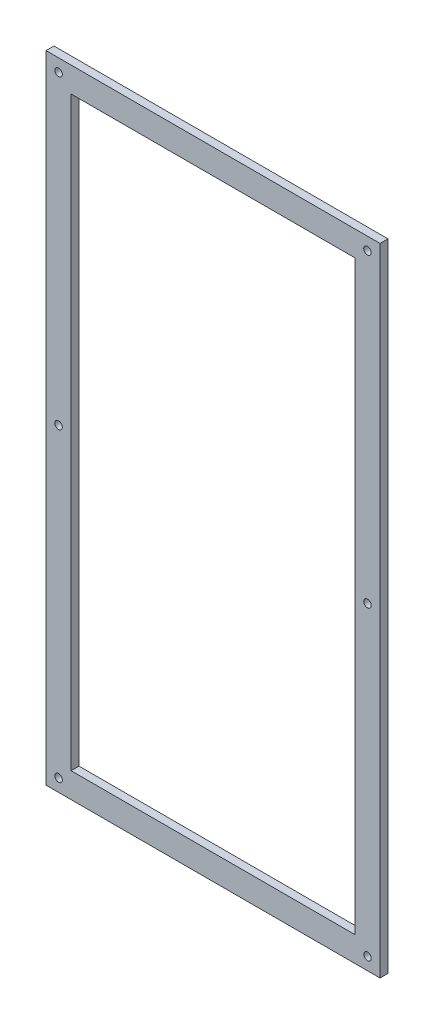
ISO-10303-21;
HEADER;
FILE_DESCRIPTION(('STEP AP214'),'2;1');
FILE_NAME('part.step','',(''),(''),'','','');
FILE_SCHEMA(('AUTOMOTIVE_DESIGN { 1 0 10303 214 1 1 1 1 }'));
ENDSEC;
DATA;
#1=APPLICATION_CONTEXT('core data for automotive mechanical design processes');
#2=APPLICATION_PROTOCOL_DEFINITION('international standard','automotive_design',2000,#1);
#3=PRODUCT_CONTEXT('',#1,'mechanical');
#4=PRODUCT('Part','Part','',(#3));
#5=PRODUCT_RELATED_PRODUCT_CATEGORY('part','',(#4));
#6=PRODUCT_DEFINITION_FORMATION('','',#4);
#7=PRODUCT_DEFINITION_CONTEXT('part definition',#1,'design');
#8=PRODUCT_DEFINITION('design','',#6,#7);
#9=PRODUCT_DEFINITION_SHAPE('','',#8);
#10=(LENGTH_UNIT() NAMED_UNIT(*) SI_UNIT(.MILLI.,.METRE.));
#11=(NAMED_UNIT(*) PLANE_ANGLE_UNIT() SI_UNIT($,.RADIAN.));
#12=(NAMED_UNIT(*) SI_UNIT($,.STERADIAN.) SOLID_ANGLE_UNIT());
#13=UNCERTAINTY_MEASURE_WITH_UNIT(LENGTH_MEASURE(1.E-05),#10,'distance_accuracy_value','');
#14=(GEOMETRIC_REPRESENTATION_CONTEXT(3) GLOBAL_UNCERTAINTY_ASSIGNED_CONTEXT((#13)) GLOBAL_UNIT_ASSIGNED_CONTEXT((#10,
#11,#12)) REPRESENTATION_CONTEXT('',''));
#15=CARTESIAN_POINT('',(0.,0.,0.));
#16=DIRECTION('',(0.,0.,1.));
#17=DIRECTION('',(1.,0.,0.));
#18=AXIS2_PLACEMENT_3D('',#15,#16,#17);
#19=CARTESIAN_POINT('',(0.,0.,3.175));
#20=DIRECTION('',(0.,0.,-1.));
#21=DIRECTION('',(-1.,0.,0.));
#22=AXIS2_PLACEMENT_3D('',#19,#20,#21);
#23=PLANE('',#22);
#24=DIRECTION('',(1.,0.,0.));
#25=VECTOR('',#24,1.);
#26=CARTESIAN_POINT('',(133.35,0.,3.175));
#27=LINE('',#26,#25);
#28=CARTESIAN_POINT('',(0.,0.,3.175));
#29=VERTEX_POINT('',#28);
#30=CARTESIAN_POINT('',(133.35,0.,3.175));
#31=VERTEX_POINT('',#30);
#32=EDGE_CURVE('E156',#29,#31,#27,.T.);
#33=ORIENTED_EDGE('',*,*,#32,.T.);
#34=DIRECTION('',(0.,1.,0.));
#35=VECTOR('',#34,1.);
#36=CARTESIAN_POINT('',(133.35,254.,3.175));
#37=LINE('',#36,#35);
#38=CARTESIAN_POINT('',(133.35,254.,3.175));
#39=VERTEX_POINT('',#38);
#40=EDGE_CURVE('E160',#31,#39,#37,.T.);
#41=ORIENTED_EDGE('',*,*,#40,.T.);
#42=DIRECTION('',(-1.,0.,0.));
#43=VECTOR('',#42,1.);
#44=CARTESIAN_POINT('',(0.,254.,3.175));
#45=LINE('',#44,#43);
#46=CARTESIAN_POINT('',(0.,254.,3.175));
#47=VERTEX_POINT('',#46);
#48=EDGE_CURVE('E164',#39,#47,#45,.T.);
#49=ORIENTED_EDGE('',*,*,#48,.T.);
#50=DIRECTION('',(0.,-1.,0.));
#51=VECTOR('',#50,1.);
#52=CARTESIAN_POINT('',(0.,0.,3.175));
#53=LINE('',#52,#51);
#54=EDGE_CURVE('E167',#47,#29,#53,.T.);
#55=ORIENTED_EDGE('',*,*,#54,.T.);
#56=EDGE_LOOP('',(#33,#41,#49,#55));
#57=FACE_BOUND('',#56,.T.);
#58=DIRECTION('',(1.,0.,0.));
#59=VECTOR('',#58,1.);
#60=CARTESIAN_POINT('',(123.35,10.,3.175));
#61=LINE('',#60,#59);
#62=CARTESIAN_POINT('',(9.99999999999999,9.99999999999999,3.175));
#63=VERTEX_POINT('',#62);
#64=CARTESIAN_POINT('',(123.35,10.,3.175));
#65=VERTEX_POINT('',#64);
#66=EDGE_CURVE('E103',#63,#65,#61,.T.);
#67=ORIENTED_EDGE('',*,*,#66,.F.);
#68=DIRECTION('',(0.,-1.,0.));
#69=VECTOR('',#68,1.);
#70=CARTESIAN_POINT('',(9.99999999999999,9.99999999999999,3.175));
#71=LINE('',#70,#69);
#72=CARTESIAN_POINT('',(10.,244.,3.175));
#73=VERTEX_POINT('',#72);
#74=EDGE_CURVE('E132',#73,#63,#71,.T.);
#75=ORIENTED_EDGE('',*,*,#74,.F.);
#76=DIRECTION('',(-1.,0.,0.));
#77=VECTOR('',#76,1.);
#78=CARTESIAN_POINT('',(10.,244.,3.175));
#79=LINE('',#78,#77);
#80=CARTESIAN_POINT('',(123.35,244.,3.175));
#81=VERTEX_POINT('',#80);
#82=EDGE_CURVE('E126',#81,#73,#79,.T.);
#83=ORIENTED_EDGE('',*,*,#82,.F.);
#84=DIRECTION('',(0.,1.,0.));
#85=VECTOR('',#84,1.);
#86=CARTESIAN_POINT('',(123.35,244.,3.175));
#87=LINE('',#86,#85);
#88=EDGE_CURVE('E112',#65,#81,#87,.T.);
#89=ORIENTED_EDGE('',*,*,#88,.F.);
#90=EDGE_LOOP('',(#67,#75,#83,#89));
#91=FACE_BOUND('',#90,.T.);
#92=CARTESIAN_POINT('',(5.,4.99999999999999,3.175));
#93=DIRECTION('',(0.,0.,1.));
#94=DIRECTION('',(1.,0.,0.));
#95=AXIS2_PLACEMENT_3D('',#92,#93,#94);
#96=CIRCLE('',#95,1.5);
#97=CARTESIAN_POINT('',(6.5,4.99999999999999,3.175));
#98=VERTEX_POINT('',#97);
#99=EDGE_CURVE('E140',#98,#98,#96,.T.);
#100=ORIENTED_EDGE('',*,*,#99,.F.);
#101=EDGE_LOOP('',(#100));
#102=FACE_BOUND('',#101,.T.);
#103=CARTESIAN_POINT('',(5.,249.,3.175));
#104=DIRECTION('',(0.,0.,1.));
#105=DIRECTION('',(-1.,0.,0.));
#106=AXIS2_PLACEMENT_3D('',#103,#104,#105);
#107=CIRCLE('',#106,1.5);
#108=CARTESIAN_POINT('',(3.5,249.,3.175));
#109=VERTEX_POINT('',#108);
#110=EDGE_CURVE('E309',#109,#109,#107,.T.);
#111=ORIENTED_EDGE('',*,*,#110,.F.);
#112=EDGE_LOOP('',(#111));
#113=FACE_BOUND('',#112,.T.);
#114=CARTESIAN_POINT('',(5.,127.,3.175));
#115=DIRECTION('',(0.,0.,1.));
#116=DIRECTION('',(1.,0.,0.));
#117=AXIS2_PLACEMENT_3D('',#114,#115,#116);
#118=CIRCLE('',#117,1.5);
#119=CARTESIAN_POINT('',(6.5,127.,3.175));
#120=VERTEX_POINT('',#119);
#121=EDGE_CURVE('E301',#120,#120,#118,.T.);
#122=ORIENTED_EDGE('',*,*,#121,.F.);
#123=EDGE_LOOP('',(#122));
#124=FACE_BOUND('',#123,.T.);
#125=CARTESIAN_POINT('',(128.35,249.,3.175));
#126=DIRECTION('',(0.,0.,1.));
#127=DIRECTION('',(1.,0.,0.));
#128=AXIS2_PLACEMENT_3D('',#125,#126,#127);
#129=CIRCLE('',#128,1.5);
#130=CARTESIAN_POINT('',(129.85,249.,3.175));
#131=VERTEX_POINT('',#130);
#132=EDGE_CURVE('E294',#131,#131,#129,.T.);
#133=ORIENTED_EDGE('',*,*,#132,.F.);
#134=EDGE_LOOP('',(#133));
#135=FACE_BOUND('',#134,.T.);
#136=CARTESIAN_POINT('',(128.35,127.,3.175));
#137=DIRECTION('',(0.,0.,1.));
#138=DIRECTION('',(-1.,0.,0.));
#139=AXIS2_PLACEMENT_3D('',#136,#137,#138);
#140=CIRCLE('',#139,1.5);
#141=CARTESIAN_POINT('',(126.85,127.,3.175));
#142=VERTEX_POINT('',#141);
#143=EDGE_CURVE('E286',#142,#142,#140,.T.);
#144=ORIENTED_EDGE('',*,*,#143,.F.);
#145=EDGE_LOOP('',(#144));
#146=FACE_BOUND('',#145,.T.);
#147=CARTESIAN_POINT('',(128.35,4.99999999999999,3.175));
#148=DIRECTION('',(0.,0.,1.));
#149=DIRECTION('',(-1.,0.,0.));
#150=AXIS2_PLACEMENT_3D('',#147,#148,#149);
#151=CIRCLE('',#150,1.5);
#152=CARTESIAN_POINT('',(126.85,4.99999999999999,3.175));
#153=VERTEX_POINT('',#152);
#154=EDGE_CURVE('E273',#153,#153,#151,.T.);
#155=ORIENTED_EDGE('',*,*,#154,.F.);
#156=EDGE_LOOP('',(#155));
#157=FACE_BOUND('',#156,.T.);
#158=ADVANCED_FACE('F37',(#57,#91,#102,#113,#124,#135,#146,#157),#23,.F.);
#159=CARTESIAN_POINT('',(0.,0.,0.));
#160=DIRECTION('',(0.,0.,-1.));
#161=DIRECTION('',(-1.,0.,0.));
#162=AXIS2_PLACEMENT_3D('',#159,#160,#161);
#163=PLANE('',#162);
#164=CARTESIAN_POINT('',(128.35,127.,0.));
#165=DIRECTION('',(0.,0.,1.));
#166=DIRECTION('',(-1.,0.,0.));
#167=AXIS2_PLACEMENT_3D('',#164,#165,#166);
#168=CIRCLE('',#167,1.5);
#169=CARTESIAN_POINT('',(126.85,127.,0.));
#170=VERTEX_POINT('',#169);
#171=EDGE_CURVE('E283',#170,#170,#168,.T.);
#172=ORIENTED_EDGE('',*,*,#171,.T.);
#173=EDGE_LOOP('',(#172));
#174=FACE_BOUND('',#173,.T.);
#175=CARTESIAN_POINT('',(5.,127.,0.));
#176=DIRECTION('',(0.,0.,1.));
#177=DIRECTION('',(1.,0.,0.));
#178=AXIS2_PLACEMENT_3D('',#175,#176,#177);
#179=CIRCLE('',#178,1.5);
#180=CARTESIAN_POINT('',(6.5,127.,0.));
#181=VERTEX_POINT('',#180);
#182=EDGE_CURVE('E298',#181,#181,#179,.T.);
#183=ORIENTED_EDGE('',*,*,#182,.T.);
#184=EDGE_LOOP('',(#183));
#185=FACE_BOUND('',#184,.T.);
#186=CARTESIAN_POINT('',(5.,4.99999999999999,0.));
#187=DIRECTION('',(0.,0.,1.));
#188=DIRECTION('',(1.,0.,0.));
#189=AXIS2_PLACEMENT_3D('',#186,#187,#188);
#190=CIRCLE('',#189,1.5);
#191=CARTESIAN_POINT('',(6.5,4.99999999999999,0.));
#192=VERTEX_POINT('',#191);
#193=EDGE_CURVE('E313',#192,#192,#190,.T.);
#194=ORIENTED_EDGE('',*,*,#193,.T.);
#195=EDGE_LOOP('',(#194));
#196=FACE_BOUND('',#195,.T.);
#197=DIRECTION('',(1.,0.,0.));
#198=VECTOR('',#197,1.);
#199=CARTESIAN_POINT('',(133.35,0.,0.));
#200=LINE('',#199,#198);
#201=CARTESIAN_POINT('',(0.,0.,0.));
#202=VERTEX_POINT('',#201);
#203=CARTESIAN_POINT('',(133.35,0.,0.));
#204=VERTEX_POINT('',#203);
#205=EDGE_CURVE('E121',#202,#204,#200,.T.);
#206=ORIENTED_EDGE('',*,*,#205,.F.);
#207=DIRECTION('',(0.,-1.,0.));
#208=VECTOR('',#207,1.);
#209=CARTESIAN_POINT('',(0.,0.,0.));
#210=LINE('',#209,#208);
#211=CARTESIAN_POINT('',(0.,254.,0.));
#212=VERTEX_POINT('',#211);
#213=EDGE_CURVE('E161',#212,#202,#210,.T.);
#214=ORIENTED_EDGE('',*,*,#213,.F.);
#215=DIRECTION('',(-1.,0.,0.));
#216=VECTOR('',#215,1.);
#217=CARTESIAN_POINT('',(0.,254.,0.));
#218=LINE('',#217,#216);
#219=CARTESIAN_POINT('',(133.35,254.,0.));
#220=VERTEX_POINT('',#219);
#221=EDGE_CURVE('E177',#220,#212,#218,.T.);
#222=ORIENTED_EDGE('',*,*,#221,.F.);
#223=DIRECTION('',(0.,1.,0.));
#224=VECTOR('',#223,1.);
#225=CARTESIAN_POINT('',(133.35,254.,0.));
#226=LINE('',#225,#224);
#227=EDGE_CURVE('E174',#204,#220,#226,.T.);
#228=ORIENTED_EDGE('',*,*,#227,.F.);
#229=EDGE_LOOP('',(#206,#214,#222,#228));
#230=FACE_BOUND('',#229,.T.);
#231=DIRECTION('',(0.,-1.,0.));
#232=VECTOR('',#231,1.);
#233=CARTESIAN_POINT('',(9.99999999999999,9.99999999999999,0.));
#234=LINE('',#233,#232);
#235=CARTESIAN_POINT('',(10.,244.,0.));
#236=VERTEX_POINT('',#235);
#237=CARTESIAN_POINT('',(9.99999999999999,9.99999999999999,0.));
#238=VERTEX_POINT('',#237);
#239=EDGE_CURVE('E113',#236,#238,#234,.T.);
#240=ORIENTED_EDGE('',*,*,#239,.T.);
#241=DIRECTION('',(1.,0.,0.));
#242=VECTOR('',#241,1.);
#243=CARTESIAN_POINT('',(123.35,10.,0.));
#244=LINE('',#243,#242);
#245=CARTESIAN_POINT('',(123.35,10.,0.));
#246=VERTEX_POINT('',#245);
#247=EDGE_CURVE('E61',#238,#246,#244,.T.);
#248=ORIENTED_EDGE('',*,*,#247,.T.);
#249=DIRECTION('',(0.,1.,0.));
#250=VECTOR('',#249,1.);
#251=CARTESIAN_POINT('',(123.35,244.,0.));
#252=LINE('',#251,#250);
#253=CARTESIAN_POINT('',(123.35,244.,0.));
#254=VERTEX_POINT('',#253);
#255=EDGE_CURVE('E119',#246,#254,#252,.T.);
#256=ORIENTED_EDGE('',*,*,#255,.T.);
#257=DIRECTION('',(-1.,0.,0.));
#258=VECTOR('',#257,1.);
#259=CARTESIAN_POINT('',(10.,244.,0.));
#260=LINE('',#259,#258);
#261=EDGE_CURVE('E143',#254,#236,#260,.T.);
#262=ORIENTED_EDGE('',*,*,#261,.T.);
#263=EDGE_LOOP('',(#240,#248,#256,#262));
#264=FACE_BOUND('',#263,.T.);
#265=CARTESIAN_POINT('',(5.,249.,0.));
#266=DIRECTION('',(0.,0.,1.));
#267=DIRECTION('',(-1.,0.,0.));
#268=AXIS2_PLACEMENT_3D('',#265,#266,#267);
#269=CIRCLE('',#268,1.5);
#270=CARTESIAN_POINT('',(3.5,249.,0.));
#271=VERTEX_POINT('',#270);
#272=EDGE_CURVE('E305',#271,#271,#269,.T.);
#273=ORIENTED_EDGE('',*,*,#272,.T.);
#274=EDGE_LOOP('',(#273));
#275=FACE_BOUND('',#274,.T.);
#276=CARTESIAN_POINT('',(128.35,249.,0.));
#277=DIRECTION('',(0.,0.,1.));
#278=DIRECTION('',(1.,0.,0.));
#279=AXIS2_PLACEMENT_3D('',#276,#277,#278);
#280=CIRCLE('',#279,1.5);
#281=CARTESIAN_POINT('',(129.85,249.,0.));
#282=VERTEX_POINT('',#281);
#283=EDGE_CURVE('E290',#282,#282,#280,.T.);
#284=ORIENTED_EDGE('',*,*,#283,.T.);
#285=EDGE_LOOP('',(#284));
#286=FACE_BOUND('',#285,.T.);
#287=CARTESIAN_POINT('',(128.35,4.99999999999999,0.));
#288=DIRECTION('',(0.,0.,1.));
#289=DIRECTION('',(-1.,0.,0.));
#290=AXIS2_PLACEMENT_3D('',#287,#288,#289);
#291=CIRCLE('',#290,1.5);
#292=CARTESIAN_POINT('',(126.85,4.99999999999999,0.));
#293=VERTEX_POINT('',#292);
#294=EDGE_CURVE('E276',#293,#293,#291,.T.);
#295=ORIENTED_EDGE('',*,*,#294,.T.);
#296=EDGE_LOOP('',(#295));
#297=FACE_BOUND('',#296,.T.);
#298=ADVANCED_FACE('F201',(#174,#185,#196,#230,#264,#275,#286,#297),#163,.T.);
#299=CARTESIAN_POINT('',(133.35,0.,3.175));
#300=DIRECTION('',(0.,1.,0.));
#301=DIRECTION('',(0.,0.,1.));
#302=AXIS2_PLACEMENT_3D('',#299,#300,#301);
#303=PLANE('',#302);
#304=ORIENTED_EDGE('',*,*,#205,.T.);
#305=DIRECTION('',(0.,0.,-1.));
#306=VECTOR('',#305,1.);
#307=CARTESIAN_POINT('',(133.35,0.,3.175));
#308=LINE('',#307,#306);
#309=EDGE_CURVE('E11',#31,#204,#308,.T.);
#310=ORIENTED_EDGE('',*,*,#309,.F.);
#311=ORIENTED_EDGE('',*,*,#32,.F.);
#312=DIRECTION('',(0.,0.,-1.));
#313=VECTOR('',#312,1.);
#314=CARTESIAN_POINT('',(0.,0.,3.175));
#315=LINE('',#314,#313);
#316=EDGE_CURVE('E170',#29,#202,#315,.T.);
#317=ORIENTED_EDGE('',*,*,#316,.T.);
#318=EDGE_LOOP('',(#304,#310,#311,#317));
#319=FACE_BOUND('',#318,.T.);
#320=ADVANCED_FACE('F39',(#319),#303,.F.);
#321=CARTESIAN_POINT('',(133.35,254.,3.175));
#322=DIRECTION('',(-1.,0.,0.));
#323=DIRECTION('',(0.,0.,1.));
#324=AXIS2_PLACEMENT_3D('',#321,#322,#323);
#325=PLANE('',#324);
#326=ORIENTED_EDGE('',*,*,#227,.T.);
#327=DIRECTION('',(0.,0.,-1.));
#328=VECTOR('',#327,1.);
#329=CARTESIAN_POINT('',(133.35,254.,3.175));
#330=LINE('',#329,#328);
#331=EDGE_CURVE('E46',#39,#220,#330,.T.);
#332=ORIENTED_EDGE('',*,*,#331,.F.);
#333=ORIENTED_EDGE('',*,*,#40,.F.);
#334=ORIENTED_EDGE('',*,*,#309,.T.);
#335=EDGE_LOOP('',(#326,#332,#333,#334));
#336=FACE_BOUND('',#335,.T.);
#337=ADVANCED_FACE('F211',(#336),#325,.F.);
#338=CARTESIAN_POINT('',(0.,254.,3.175));
#339=DIRECTION('',(0.,-1.,0.));
#340=DIRECTION('',(0.,0.,-1.));
#341=AXIS2_PLACEMENT_3D('',#338,#339,#340);
#342=PLANE('',#341);
#343=ORIENTED_EDGE('',*,*,#221,.T.);
#344=DIRECTION('',(0.,0.,-1.));
#345=VECTOR('',#344,1.);
#346=CARTESIAN_POINT('',(0.,254.,3.175));
#347=LINE('',#346,#345);
#348=EDGE_CURVE('E185',#47,#212,#347,.T.);
#349=ORIENTED_EDGE('',*,*,#348,.F.);
#350=ORIENTED_EDGE('',*,*,#48,.F.);
#351=ORIENTED_EDGE('',*,*,#331,.T.);
#352=EDGE_LOOP('',(#343,#349,#350,#351));
#353=FACE_BOUND('',#352,.T.);
#354=ADVANCED_FACE('F195',(#353),#342,.F.);
#355=CARTESIAN_POINT('',(0.,0.,3.175));
#356=DIRECTION('',(1.,0.,0.));
#357=DIRECTION('',(0.,0.,-1.));
#358=AXIS2_PLACEMENT_3D('',#355,#356,#357);
#359=PLANE('',#358);
#360=ORIENTED_EDGE('',*,*,#213,.T.);
#361=ORIENTED_EDGE('',*,*,#316,.F.);
#362=ORIENTED_EDGE('',*,*,#54,.F.);
#363=ORIENTED_EDGE('',*,*,#348,.T.);
#364=EDGE_LOOP('',(#360,#361,#362,#363));
#365=FACE_BOUND('',#364,.T.);
#366=ADVANCED_FACE('F205',(#365),#359,.F.);
#367=CARTESIAN_POINT('',(123.35,10.,3.175));
#368=DIRECTION('',(0.,1.,0.));
#369=DIRECTION('',(-1.,0.,0.));
#370=AXIS2_PLACEMENT_3D('',#367,#368,#369);
#371=PLANE('',#370);
#372=ORIENTED_EDGE('',*,*,#247,.F.);
#373=DIRECTION('',(0.,0.,-1.));
#374=VECTOR('',#373,1.);
#375=CARTESIAN_POINT('',(9.99999999999999,9.99999999999999,3.175));
#376=LINE('',#375,#374);
#377=EDGE_CURVE('E107',#63,#238,#376,.T.);
#378=ORIENTED_EDGE('',*,*,#377,.F.);
#379=ORIENTED_EDGE('',*,*,#66,.T.);
#380=DIRECTION('',(0.,0.,-1.));
#381=VECTOR('',#380,1.);
#382=CARTESIAN_POINT('',(123.35,10.,3.175));
#383=LINE('',#382,#381);
#384=EDGE_CURVE('E106',#65,#246,#383,.T.);
#385=ORIENTED_EDGE('',*,*,#384,.T.);
#386=EDGE_LOOP('',(#372,#378,#379,#385));
#387=FACE_BOUND('',#386,.T.);
#388=ADVANCED_FACE('F105',(#387),#371,.T.);
#389=CARTESIAN_POINT('',(123.35,244.,3.175));
#390=DIRECTION('',(-1.,0.,0.));
#391=DIRECTION('',(0.,-1.,0.));
#392=AXIS2_PLACEMENT_3D('',#389,#390,#391);
#393=PLANE('',#392);
#394=ORIENTED_EDGE('',*,*,#255,.F.);
#395=ORIENTED_EDGE('',*,*,#384,.F.);
#396=ORIENTED_EDGE('',*,*,#88,.T.);
#397=DIRECTION('',(0.,0.,-1.));
#398=VECTOR('',#397,1.);
#399=CARTESIAN_POINT('',(123.35,244.,3.175));
#400=LINE('',#399,#398);
#401=EDGE_CURVE('E122',#81,#254,#400,.T.);
#402=ORIENTED_EDGE('',*,*,#401,.T.);
#403=EDGE_LOOP('',(#394,#395,#396,#402));
#404=FACE_BOUND('',#403,.T.);
#405=ADVANCED_FACE('F116',(#404),#393,.T.);
#406=CARTESIAN_POINT('',(10.,244.,3.175));
#407=DIRECTION('',(0.,-1.,0.));
#408=DIRECTION('',(0.,0.,-1.));
#409=AXIS2_PLACEMENT_3D('',#406,#407,#408);
#410=PLANE('',#409);
#411=ORIENTED_EDGE('',*,*,#261,.F.);
#412=ORIENTED_EDGE('',*,*,#401,.F.);
#413=ORIENTED_EDGE('',*,*,#82,.T.);
#414=DIRECTION('',(0.,0.,-1.));
#415=VECTOR('',#414,1.);
#416=CARTESIAN_POINT('',(10.,244.,3.175));
#417=LINE('',#416,#415);
#418=EDGE_CURVE('E53',#73,#236,#417,.T.);
#419=ORIENTED_EDGE('',*,*,#418,.T.);
#420=EDGE_LOOP('',(#411,#412,#413,#419));
#421=FACE_BOUND('',#420,.T.);
#422=ADVANCED_FACE('F235',(#421),#410,.T.);
#423=CARTESIAN_POINT('',(9.99999999999999,9.99999999999999,3.175));
#424=DIRECTION('',(1.,0.,0.));
#425=DIRECTION('',(0.,1.,0.));
#426=AXIS2_PLACEMENT_3D('',#423,#424,#425);
#427=PLANE('',#426);
#428=ORIENTED_EDGE('',*,*,#239,.F.);
#429=ORIENTED_EDGE('',*,*,#418,.F.);
#430=ORIENTED_EDGE('',*,*,#74,.T.);
#431=ORIENTED_EDGE('',*,*,#377,.T.);
#432=EDGE_LOOP('',(#428,#429,#430,#431));
#433=FACE_BOUND('',#432,.T.);
#434=ADVANCED_FACE('F239',(#433),#427,.T.);
#435=CARTESIAN_POINT('',(5.,4.99999999999999,3.175));
#436=DIRECTION('',(0.,0.,-1.));
#437=DIRECTION('',(-1.,0.,0.));
#438=AXIS2_PLACEMENT_3D('',#435,#436,#437);
#439=CYLINDRICAL_SURFACE('',#438,1.5);
#440=ORIENTED_EDGE('',*,*,#99,.T.);
#441=EDGE_LOOP('',(#440));
#442=FACE_BOUND('',#441,.T.);
#443=ORIENTED_EDGE('',*,*,#193,.F.);
#444=EDGE_LOOP('',(#443));
#445=FACE_BOUND('',#444,.T.);
#446=ADVANCED_FACE('F245',(#442,#445),#439,.F.);
#447=CARTESIAN_POINT('',(5.,249.,3.175));
#448=DIRECTION('',(0.,0.,-1.));
#449=DIRECTION('',(-1.,0.,0.));
#450=AXIS2_PLACEMENT_3D('',#447,#448,#449);
#451=CYLINDRICAL_SURFACE('',#450,1.5);
#452=ORIENTED_EDGE('',*,*,#110,.T.);
#453=EDGE_LOOP('',(#452));
#454=FACE_BOUND('',#453,.T.);
#455=ORIENTED_EDGE('',*,*,#272,.F.);
#456=EDGE_LOOP('',(#455));
#457=FACE_BOUND('',#456,.T.);
#458=ADVANCED_FACE('F248',(#454,#457),#451,.F.);
#459=CARTESIAN_POINT('',(5.,127.,3.175));
#460=DIRECTION('',(0.,0.,-1.));
#461=DIRECTION('',(-1.,0.,0.));
#462=AXIS2_PLACEMENT_3D('',#459,#460,#461);
#463=CYLINDRICAL_SURFACE('',#462,1.5);
#464=ORIENTED_EDGE('',*,*,#121,.T.);
#465=EDGE_LOOP('',(#464));
#466=FACE_BOUND('',#465,.T.);
#467=ORIENTED_EDGE('',*,*,#182,.F.);
#468=EDGE_LOOP('',(#467));
#469=FACE_BOUND('',#468,.T.);
#470=ADVANCED_FACE('F252',(#466,#469),#463,.F.);
#471=CARTESIAN_POINT('',(128.35,249.,3.175));
#472=DIRECTION('',(0.,0.,-1.));
#473=DIRECTION('',(-1.,0.,0.));
#474=AXIS2_PLACEMENT_3D('',#471,#472,#473);
#475=CYLINDRICAL_SURFACE('',#474,1.5);
#476=ORIENTED_EDGE('',*,*,#132,.T.);
#477=EDGE_LOOP('',(#476));
#478=FACE_BOUND('',#477,.T.);
#479=ORIENTED_EDGE('',*,*,#283,.F.);
#480=EDGE_LOOP('',(#479));
#481=FACE_BOUND('',#480,.T.);
#482=ADVANCED_FACE('F256',(#478,#481),#475,.F.);
#483=CARTESIAN_POINT('',(128.35,127.,3.175));
#484=DIRECTION('',(0.,0.,-1.));
#485=DIRECTION('',(-1.,0.,0.));
#486=AXIS2_PLACEMENT_3D('',#483,#484,#485);
#487=CYLINDRICAL_SURFACE('',#486,1.5);
#488=ORIENTED_EDGE('',*,*,#143,.T.);
#489=EDGE_LOOP('',(#488));
#490=FACE_BOUND('',#489,.T.);
#491=ORIENTED_EDGE('',*,*,#171,.F.);
#492=EDGE_LOOP('',(#491));
#493=FACE_BOUND('',#492,.T.);
#494=ADVANCED_FACE('F260',(#490,#493),#487,.F.);
#495=CARTESIAN_POINT('',(128.35,4.99999999999999,3.175));
#496=DIRECTION('',(0.,0.,-1.));
#497=DIRECTION('',(-1.,0.,0.));
#498=AXIS2_PLACEMENT_3D('',#495,#496,#497);
#499=CYLINDRICAL_SURFACE('',#498,1.5);
#500=ORIENTED_EDGE('',*,*,#154,.T.);
#501=EDGE_LOOP('',(#500));
#502=FACE_BOUND('',#501,.T.);
#503=ORIENTED_EDGE('',*,*,#294,.F.);
#504=EDGE_LOOP('',(#503));
#505=FACE_BOUND('',#504,.T.);
#506=ADVANCED_FACE('F264',(#502,#505),#499,.F.);
#507=CLOSED_SHELL('',(#158,#298,#320,#337,#354,#366,#388,#405,#422,#434,#446,#458,#470,#482,
#494,#506));
#508=MANIFOLD_SOLID_BREP('B2',#507);
#509=ADVANCED_BREP_SHAPE_REPRESENTATION('',(#18,#508),#14);
#510=SHAPE_DEFINITION_REPRESENTATION(#9,#509);
ENDSEC;
END-ISO-10303-21;
